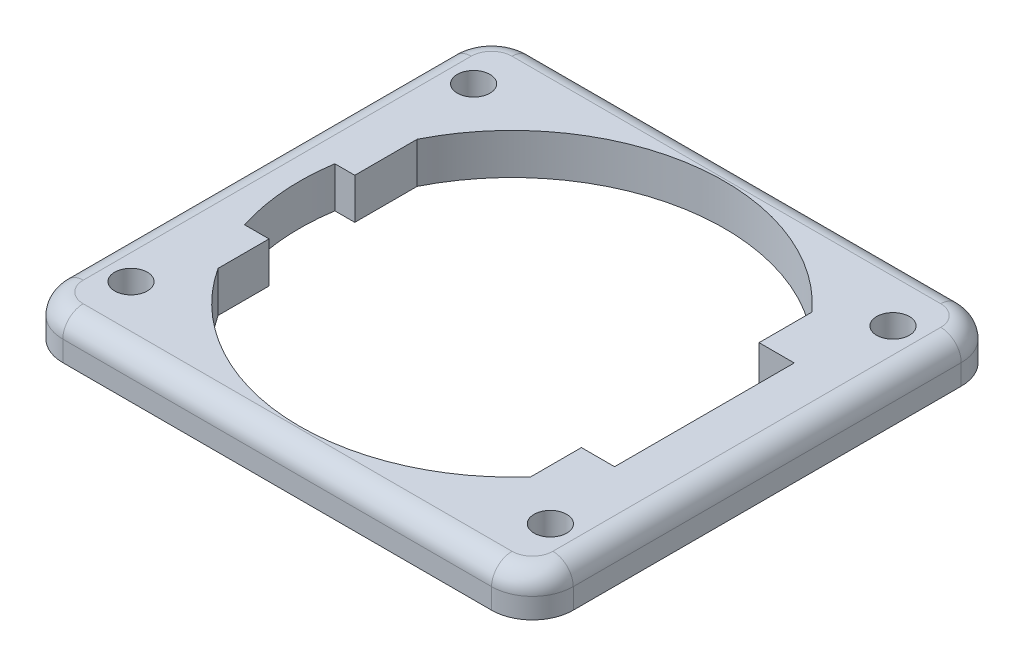
ISO-10303-21;
HEADER;
FILE_DESCRIPTION(('STEP AP214'),'2;1');
FILE_NAME('part.step','',(''),(''),'','','');
FILE_SCHEMA(('AUTOMOTIVE_DESIGN { 1 0 10303 214 1 1 1 1 }'));
ENDSEC;
DATA;
#1=APPLICATION_CONTEXT('core data for automotive mechanical design processes');
#2=APPLICATION_PROTOCOL_DEFINITION('international standard','automotive_design',2000,#1);
#3=PRODUCT_CONTEXT('',#1,'mechanical');
#4=PRODUCT('Part','Part','',(#3));
#5=PRODUCT_RELATED_PRODUCT_CATEGORY('part','',(#4));
#6=PRODUCT_DEFINITION_FORMATION('','',#4);
#7=PRODUCT_DEFINITION_CONTEXT('part definition',#1,'design');
#8=PRODUCT_DEFINITION('design','',#6,#7);
#9=PRODUCT_DEFINITION_SHAPE('','',#8);
#10=(LENGTH_UNIT() NAMED_UNIT(*) SI_UNIT(.MILLI.,.METRE.));
#11=(NAMED_UNIT(*) PLANE_ANGLE_UNIT() SI_UNIT($,.RADIAN.));
#12=(NAMED_UNIT(*) SI_UNIT($,.STERADIAN.) SOLID_ANGLE_UNIT());
#13=UNCERTAINTY_MEASURE_WITH_UNIT(LENGTH_MEASURE(1.E-05),#10,'distance_accuracy_value','');
#14=(GEOMETRIC_REPRESENTATION_CONTEXT(3) GLOBAL_UNCERTAINTY_ASSIGNED_CONTEXT((#13)) GLOBAL_UNIT_ASSIGNED_CONTEXT((#10,
#11,#12)) REPRESENTATION_CONTEXT('',''));
#15=CARTESIAN_POINT('',(0.,0.,0.));
#16=DIRECTION('',(0.,0.,1.));
#17=DIRECTION('',(1.,0.,0.));
#18=AXIS2_PLACEMENT_3D('',#15,#16,#17);
#19=CARTESIAN_POINT('',(0.,2.54,0.));
#20=DIRECTION('',(0.,1.,0.));
#21=DIRECTION('',(0.,0.,1.));
#22=AXIS2_PLACEMENT_3D('',#19,#20,#21);
#23=PLANE('',#22);
#24=CARTESIAN_POINT('',(13.0429,2.54,10.6553));
#25=DIRECTION('',(0.,-1.,0.));
#26=DIRECTION('',(0.,0.,1.));
#27=AXIS2_PLACEMENT_3D('',#24,#25,#26);
#28=CIRCLE('',#27,1.016);
#29=CARTESIAN_POINT('',(13.0429,2.54,11.6713));
#30=VERTEX_POINT('',#29);
#31=EDGE_CURVE('E794',#30,#30,#28,.T.);
#32=ORIENTED_EDGE('',*,*,#31,.T.);
#33=EDGE_LOOP('',(#32));
#34=FACE_BOUND('',#33,.T.);
#35=CARTESIAN_POINT('',(-13.0429,2.54,10.6553));
#36=DIRECTION('',(0.,-1.,0.));
#37=DIRECTION('',(0.,0.,-1.));
#38=AXIS2_PLACEMENT_3D('',#35,#36,#37);
#39=CIRCLE('',#38,1.016);
#40=CARTESIAN_POINT('',(-13.0429,2.54,9.63929999999999));
#41=VERTEX_POINT('',#40);
#42=EDGE_CURVE('E814',#41,#41,#39,.T.);
#43=ORIENTED_EDGE('',*,*,#42,.T.);
#44=EDGE_LOOP('',(#43));
#45=FACE_BOUND('',#44,.T.);
#46=CARTESIAN_POINT('',(-13.0429,2.54,-10.6553));
#47=DIRECTION('',(0.,-1.,0.));
#48=DIRECTION('',(0.,0.,1.));
#49=AXIS2_PLACEMENT_3D('',#46,#47,#48);
#50=CIRCLE('',#49,1.016);
#51=CARTESIAN_POINT('',(-13.0429,2.54,-9.63929999999999));
#52=VERTEX_POINT('',#51);
#53=EDGE_CURVE('E805',#52,#52,#50,.T.);
#54=ORIENTED_EDGE('',*,*,#53,.T.);
#55=EDGE_LOOP('',(#54));
#56=FACE_BOUND('',#55,.T.);
#57=CARTESIAN_POINT('',(13.0429,2.54,-10.6553));
#58=DIRECTION('',(0.,-1.,0.));
#59=DIRECTION('',(0.,0.,-1.));
#60=AXIS2_PLACEMENT_3D('',#57,#58,#59);
#61=CIRCLE('',#60,1.016);
#62=CARTESIAN_POINT('',(13.0429,2.54,-11.6713));
#63=VERTEX_POINT('',#62);
#64=EDGE_CURVE('E229',#63,#63,#61,.T.);
#65=ORIENTED_EDGE('',*,*,#64,.T.);
#66=EDGE_LOOP('',(#65));
#67=FACE_BOUND('',#66,.T.);
#68=CARTESIAN_POINT('',(0.,2.54,0.));
#69=DIRECTION('',(0.,1.,0.));
#70=DIRECTION('',(0.,0.,1.));
#71=AXIS2_PLACEMENT_3D('',#68,#69,#70);
#72=CIRCLE('',#71,13.208);
#73=CARTESIAN_POINT('',(9.779,2.54,-8.87819931067106));
#74=VERTEX_POINT('',#73);
#75=CARTESIAN_POINT('',(-11.811,2.54,-5.91198300065215));
#76=VERTEX_POINT('',#75);
#77=EDGE_CURVE('E277',#74,#76,#72,.T.);
#78=ORIENTED_EDGE('',*,*,#77,.F.);
#79=DIRECTION('',(0.,0.,1.));
#80=VECTOR('',#79,1.);
#81=CARTESIAN_POINT('',(9.779,2.54,-10.2275217065993));
#82=LINE('',#81,#80);
#83=CARTESIAN_POINT('',(9.779,2.54,-5.588));
#84=VERTEX_POINT('',#83);
#85=EDGE_CURVE('E227',#74,#84,#82,.T.);
#86=ORIENTED_EDGE('',*,*,#85,.T.);
#87=DIRECTION('',(1.,0.,0.));
#88=VECTOR('',#87,1.);
#89=CARTESIAN_POINT('',(15.875,2.54,-5.588));
#90=LINE('',#89,#88);
#91=CARTESIAN_POINT('',(11.96768649322,2.54,-5.588));
#92=VERTEX_POINT('',#91);
#93=EDGE_CURVE('E211',#84,#92,#90,.T.);
#94=ORIENTED_EDGE('',*,*,#93,.T.);
#95=DIRECTION('',(0.,0.,-1.));
#96=VECTOR('',#95,1.);
#97=CARTESIAN_POINT('',(11.96768649322,2.54,-5.588));
#98=LINE('',#97,#96);
#99=CARTESIAN_POINT('',(11.96768649322,2.54,5.588));
#100=VERTEX_POINT('',#99);
#101=EDGE_CURVE('E279',#100,#92,#98,.T.);
#102=ORIENTED_EDGE('',*,*,#101,.F.);
#103=DIRECTION('',(-1.,0.,0.));
#104=VECTOR('',#103,1.);
#105=CARTESIAN_POINT('',(15.875,2.54,5.588));
#106=LINE('',#105,#104);
#107=CARTESIAN_POINT('',(9.906,2.54,5.588));
#108=VERTEX_POINT('',#107);
#109=EDGE_CURVE('E232',#100,#108,#106,.T.);
#110=ORIENTED_EDGE('',*,*,#109,.T.);
#111=DIRECTION('',(0.,0.,1.));
#112=VECTOR('',#111,1.);
#113=CARTESIAN_POINT('',(9.906,2.54,5.588));
#114=LINE('',#113,#112);
#115=CARTESIAN_POINT('',(9.906,2.54,8.73627082913528));
#116=VERTEX_POINT('',#115);
#117=EDGE_CURVE('E236',#108,#116,#114,.T.);
#118=ORIENTED_EDGE('',*,*,#117,.T.);
#119=CARTESIAN_POINT('',(-11.049,2.54,7.23677158683346));
#120=VERTEX_POINT('',#119);
#121=EDGE_CURVE('E270',#120,#116,#72,.T.);
#122=ORIENTED_EDGE('',*,*,#121,.F.);
#123=DIRECTION('',(0.,0.,-1.));
#124=VECTOR('',#123,1.);
#125=CARTESIAN_POINT('',(-11.049,2.54,14.605));
#126=LINE('',#125,#124);
#127=CARTESIAN_POINT('',(-11.049,2.54,4.064));
#128=VERTEX_POINT('',#127);
#129=EDGE_CURVE('E244',#120,#128,#126,.T.);
#130=ORIENTED_EDGE('',*,*,#129,.T.);
#131=DIRECTION('',(-1.,0.,0.));
#132=VECTOR('',#131,1.);
#133=CARTESIAN_POINT('',(-15.875,2.54,4.064));
#134=LINE('',#133,#132);
#135=CARTESIAN_POINT('',(-12.5672259468826,2.54,4.064));
#136=VERTEX_POINT('',#135);
#137=EDGE_CURVE('E248',#128,#136,#134,.T.);
#138=ORIENTED_EDGE('',*,*,#137,.T.);
#139=CARTESIAN_POINT('',(-13.0507562999238,2.54,-2.032));
#140=VERTEX_POINT('',#139);
#141=EDGE_CURVE('E280',#140,#136,#72,.T.);
#142=ORIENTED_EDGE('',*,*,#141,.F.);
#143=DIRECTION('',(1.,0.,0.));
#144=VECTOR('',#143,1.);
#145=CARTESIAN_POINT('',(-15.875,2.54,-2.032));
#146=LINE('',#145,#144);
#147=CARTESIAN_POINT('',(-11.811,2.54,-2.032));
#148=VERTEX_POINT('',#147);
#149=EDGE_CURVE('E257',#140,#148,#146,.T.);
#150=ORIENTED_EDGE('',*,*,#149,.T.);
#151=DIRECTION('',(0.,0.,-1.));
#152=VECTOR('',#151,1.);
#153=CARTESIAN_POINT('',(-11.811,2.54,-6.2959526167384));
#154=LINE('',#153,#152);
#155=EDGE_CURVE('E261',#148,#76,#154,.T.);
#156=ORIENTED_EDGE('',*,*,#155,.T.);
#157=EDGE_LOOP('',(#78,#86,#94,#102,#110,#118,#122,#130,#138,#142,#150,#156));
#158=FACE_BOUND('',#157,.T.);
#159=CARTESIAN_POINT('',(13.335,2.54,12.065));
#160=DIRECTION('',(0.,1.,0.));
#161=DIRECTION('',(0.,0.,1.));
#162=AXIS2_PLACEMENT_3D('',#159,#160,#161);
#163=CIRCLE('',#162,1.27);
#164=CARTESIAN_POINT('',(14.605,2.54,12.065));
#165=VERTEX_POINT('',#164);
#166=CARTESIAN_POINT('',(13.335,2.54,13.335));
#167=VERTEX_POINT('',#166);
#168=EDGE_CURVE('E341',#165,#167,#163,.F.);
#169=ORIENTED_EDGE('',*,*,#168,.F.);
#170=DIRECTION('',(0.,0.,-1.));
#171=VECTOR('',#170,1.);
#172=CARTESIAN_POINT('',(14.605,2.54,-14.605));
#173=LINE('',#172,#171);
#174=CARTESIAN_POINT('',(14.605,2.54,-12.065));
#175=VERTEX_POINT('',#174);
#176=EDGE_CURVE('E314',#165,#175,#173,.T.);
#177=ORIENTED_EDGE('',*,*,#176,.T.);
#178=CARTESIAN_POINT('',(13.335,2.54,-12.065));
#179=DIRECTION('',(0.,1.,0.));
#180=DIRECTION('',(0.,0.,1.));
#181=AXIS2_PLACEMENT_3D('',#178,#179,#180);
#182=CIRCLE('',#181,1.27);
#183=CARTESIAN_POINT('',(13.335,2.54,-13.335));
#184=VERTEX_POINT('',#183);
#185=EDGE_CURVE('E334',#184,#175,#182,.F.);
#186=ORIENTED_EDGE('',*,*,#185,.F.);
#187=DIRECTION('',(-1.,0.,0.));
#188=VECTOR('',#187,1.);
#189=CARTESIAN_POINT('',(-15.875,2.54,-13.335));
#190=LINE('',#189,#188);
#191=CARTESIAN_POINT('',(-13.335,2.54,-13.335));
#192=VERTEX_POINT('',#191);
#193=EDGE_CURVE('E317',#184,#192,#190,.T.);
#194=ORIENTED_EDGE('',*,*,#193,.T.);
#195=CARTESIAN_POINT('',(-13.335,2.54,-12.065));
#196=DIRECTION('',(0.,1.,0.));
#197=DIRECTION('',(0.,0.,1.));
#198=AXIS2_PLACEMENT_3D('',#195,#196,#197);
#199=CIRCLE('',#198,1.27);
#200=CARTESIAN_POINT('',(-14.605,2.54,-12.065));
#201=VERTEX_POINT('',#200);
#202=EDGE_CURVE('E336',#201,#192,#199,.F.);
#203=ORIENTED_EDGE('',*,*,#202,.F.);
#204=DIRECTION('',(0.,0.,1.));
#205=VECTOR('',#204,1.);
#206=CARTESIAN_POINT('',(-14.605,2.54,14.605));
#207=LINE('',#206,#205);
#208=CARTESIAN_POINT('',(-14.605,2.54,12.065));
#209=VERTEX_POINT('',#208);
#210=EDGE_CURVE('E320',#201,#209,#207,.T.);
#211=ORIENTED_EDGE('',*,*,#210,.T.);
#212=CARTESIAN_POINT('',(-13.335,2.54,12.065));
#213=DIRECTION('',(0.,1.,0.));
#214=DIRECTION('',(0.,0.,1.));
#215=AXIS2_PLACEMENT_3D('',#212,#213,#214);
#216=CIRCLE('',#215,1.27);
#217=CARTESIAN_POINT('',(-13.335,2.54,13.335));
#218=VERTEX_POINT('',#217);
#219=EDGE_CURVE('E338',#218,#209,#216,.F.);
#220=ORIENTED_EDGE('',*,*,#219,.F.);
#221=DIRECTION('',(1.,0.,0.));
#222=VECTOR('',#221,1.);
#223=CARTESIAN_POINT('',(15.875,2.54,13.335));
#224=LINE('',#223,#222);
#225=EDGE_CURVE('E311',#218,#167,#224,.T.);
#226=ORIENTED_EDGE('',*,*,#225,.T.);
#227=EDGE_LOOP('',(#169,#177,#186,#194,#203,#211,#220,#226));
#228=FACE_BOUND('',#227,.T.);
#229=ADVANCED_FACE('F36',(#34,#45,#56,#67,#158,#228),#23,.T.);
#230=CARTESIAN_POINT('',(0.,0.,0.));
#231=DIRECTION('',(0.,1.,0.));
#232=DIRECTION('',(0.,0.,1.));
#233=AXIS2_PLACEMENT_3D('',#230,#231,#232);
#234=CYLINDRICAL_SURFACE('',#233,13.208);
#235=ORIENTED_EDGE('',*,*,#141,.T.);
#236=DIRECTION('',(0.,1.,0.));
#237=VECTOR('',#236,1.);
#238=CARTESIAN_POINT('',(-12.5672259468826,0.,4.064));
#239=LINE('',#238,#237);
#240=CARTESIAN_POINT('',(-12.5672259468826,0.,4.064));
#241=VERTEX_POINT('',#240);
#242=EDGE_CURVE('E306',#136,#241,#239,.F.);
#243=ORIENTED_EDGE('',*,*,#242,.T.);
#244=CARTESIAN_POINT('',(0.,0.,0.));
#245=DIRECTION('',(0.,1.,0.));
#246=DIRECTION('',(0.,0.,1.));
#247=AXIS2_PLACEMENT_3D('',#244,#245,#246);
#248=CIRCLE('',#247,13.208);
#249=CARTESIAN_POINT('',(-13.0507562999238,0.,-2.032));
#250=VERTEX_POINT('',#249);
#251=EDGE_CURVE('E273',#250,#241,#248,.T.);
#252=ORIENTED_EDGE('',*,*,#251,.F.);
#253=DIRECTION('',(0.,1.,0.));
#254=VECTOR('',#253,1.);
#255=CARTESIAN_POINT('',(-13.0507562999238,0.,-2.032));
#256=LINE('',#255,#254);
#257=EDGE_CURVE('E297',#250,#140,#256,.T.);
#258=ORIENTED_EDGE('',*,*,#257,.T.);
#259=EDGE_LOOP('',(#235,#243,#252,#258));
#260=FACE_BOUND('',#259,.T.);
#261=ADVANCED_FACE('F462',(#260),#234,.F.);
#262=CARTESIAN_POINT('',(9.779,0.,-8.87819931067106));
#263=VERTEX_POINT('',#262);
#264=CARTESIAN_POINT('',(-11.811,0.,-5.91198300065215));
#265=VERTEX_POINT('',#264);
#266=EDGE_CURVE('E271',#263,#265,#248,.T.);
#267=ORIENTED_EDGE('',*,*,#266,.F.);
#268=DIRECTION('',(0.,1.,0.));
#269=VECTOR('',#268,1.);
#270=CARTESIAN_POINT('',(9.779,0.,-8.87819931067106));
#271=LINE('',#270,#269);
#272=EDGE_CURVE('E207',#263,#74,#271,.T.);
#273=ORIENTED_EDGE('',*,*,#272,.T.);
#274=ORIENTED_EDGE('',*,*,#77,.T.);
#275=DIRECTION('',(0.,1.,0.));
#276=VECTOR('',#275,1.);
#277=CARTESIAN_POINT('',(-11.811,0.,-5.91198300065215));
#278=LINE('',#277,#276);
#279=EDGE_CURVE('E300',#76,#265,#278,.F.);
#280=ORIENTED_EDGE('',*,*,#279,.T.);
#281=EDGE_LOOP('',(#267,#273,#274,#280));
#282=FACE_BOUND('',#281,.T.);
#283=ADVANCED_FACE('F468',(#282),#234,.F.);
#284=CARTESIAN_POINT('',(-15.875,2.54,-14.605));
#285=DIRECTION('',(1.,0.,0.));
#286=DIRECTION('',(0.,0.,-1.));
#287=AXIS2_PLACEMENT_3D('',#284,#285,#286);
#288=PLANE('',#287);
#289=DIRECTION('',(0.,0.,1.));
#290=VECTOR('',#289,1.);
#291=CARTESIAN_POINT('',(-15.875,1.27,-14.605));
#292=LINE('',#291,#290);
#293=CARTESIAN_POINT('',(-15.875,1.27,12.065));
#294=VERTEX_POINT('',#293);
#295=CARTESIAN_POINT('',(-15.875,1.27,-12.065));
#296=VERTEX_POINT('',#295);
#297=EDGE_CURVE('E323',#294,#296,#292,.F.);
#298=ORIENTED_EDGE('',*,*,#297,.T.);
#299=DIRECTION('',(0.,-1.,0.));
#300=VECTOR('',#299,1.);
#301=CARTESIAN_POINT('',(-15.875,2.54,-12.065));
#302=LINE('',#301,#300);
#303=CARTESIAN_POINT('',(-15.875,0.,-12.065));
#304=VERTEX_POINT('',#303);
#305=EDGE_CURVE('E60',#296,#304,#302,.T.);
#306=ORIENTED_EDGE('',*,*,#305,.T.);
#307=DIRECTION('',(0.,0.,1.));
#308=VECTOR('',#307,1.);
#309=CARTESIAN_POINT('',(-15.875,0.,-14.605));
#310=LINE('',#309,#308);
#311=CARTESIAN_POINT('',(-15.875,0.,12.065));
#312=VERTEX_POINT('',#311);
#313=EDGE_CURVE('E284',#304,#312,#310,.T.);
#314=ORIENTED_EDGE('',*,*,#313,.T.);
#315=DIRECTION('',(0.,-1.,0.));
#316=VECTOR('',#315,1.);
#317=CARTESIAN_POINT('',(-15.875,2.54,12.065));
#318=LINE('',#317,#316);
#319=EDGE_CURVE('E377',#312,#294,#318,.F.);
#320=ORIENTED_EDGE('',*,*,#319,.T.);
#321=EDGE_LOOP('',(#298,#306,#314,#320));
#322=FACE_BOUND('',#321,.T.);
#323=ADVANCED_FACE('F449',(#322),#288,.F.);
#324=CARTESIAN_POINT('',(-15.875,2.54,14.605));
#325=DIRECTION('',(0.,0.,-1.));
#326=DIRECTION('',(-1.,0.,0.));
#327=AXIS2_PLACEMENT_3D('',#324,#325,#326);
#328=PLANE('',#327);
#329=DIRECTION('',(1.,0.,0.));
#330=VECTOR('',#329,1.);
#331=CARTESIAN_POINT('',(-15.875,1.27,14.605));
#332=LINE('',#331,#330);
#333=CARTESIAN_POINT('',(13.335,1.27,14.605));
#334=VERTEX_POINT('',#333);
#335=CARTESIAN_POINT('',(-13.335,1.27,14.605));
#336=VERTEX_POINT('',#335);
#337=EDGE_CURVE('E331',#334,#336,#332,.F.);
#338=ORIENTED_EDGE('',*,*,#337,.T.);
#339=DIRECTION('',(0.,-1.,0.));
#340=VECTOR('',#339,1.);
#341=CARTESIAN_POINT('',(-13.335,2.54,14.605));
#342=LINE('',#341,#340);
#343=CARTESIAN_POINT('',(-13.335,0.,14.605));
#344=VERTEX_POINT('',#343);
#345=EDGE_CURVE('E11',#336,#344,#342,.T.);
#346=ORIENTED_EDGE('',*,*,#345,.T.);
#347=DIRECTION('',(1.,0.,0.));
#348=VECTOR('',#347,1.);
#349=CARTESIAN_POINT('',(-15.875,0.,14.605));
#350=LINE('',#349,#348);
#351=CARTESIAN_POINT('',(13.335,0.,14.605));
#352=VERTEX_POINT('',#351);
#353=EDGE_CURVE('E288',#344,#352,#350,.T.);
#354=ORIENTED_EDGE('',*,*,#353,.T.);
#355=DIRECTION('',(0.,-1.,0.));
#356=VECTOR('',#355,1.);
#357=CARTESIAN_POINT('',(13.335,2.54,14.605));
#358=LINE('',#357,#356);
#359=EDGE_CURVE('E45',#352,#334,#358,.F.);
#360=ORIENTED_EDGE('',*,*,#359,.T.);
#361=EDGE_LOOP('',(#338,#346,#354,#360));
#362=FACE_BOUND('',#361,.T.);
#363=ADVANCED_FACE('F444',(#362),#328,.F.);
#364=CARTESIAN_POINT('',(15.875,2.54,-14.605));
#365=DIRECTION('',(-1.,0.,0.));
#366=DIRECTION('',(0.,0.,1.));
#367=AXIS2_PLACEMENT_3D('',#364,#365,#366);
#368=PLANE('',#367);
#369=DIRECTION('',(0.,0.,-1.));
#370=VECTOR('',#369,1.);
#371=CARTESIAN_POINT('',(15.875,0.,-14.605));
#372=LINE('',#371,#370);
#373=CARTESIAN_POINT('',(15.875,0.,12.065));
#374=VERTEX_POINT('',#373);
#375=CARTESIAN_POINT('',(15.875,0.,-12.065));
#376=VERTEX_POINT('',#375);
#377=EDGE_CURVE('E291',#374,#376,#372,.T.);
#378=ORIENTED_EDGE('',*,*,#377,.T.);
#379=DIRECTION('',(0.,-1.,0.));
#380=VECTOR('',#379,1.);
#381=CARTESIAN_POINT('',(15.875,2.54,-12.065));
#382=LINE('',#381,#380);
#383=CARTESIAN_POINT('',(15.875,1.27,-12.065));
#384=VERTEX_POINT('',#383);
#385=EDGE_CURVE('E375',#376,#384,#382,.F.);
#386=ORIENTED_EDGE('',*,*,#385,.T.);
#387=DIRECTION('',(0.,0.,-1.));
#388=VECTOR('',#387,1.);
#389=CARTESIAN_POINT('',(15.875,1.27,14.605));
#390=LINE('',#389,#388);
#391=CARTESIAN_POINT('',(15.875,1.27,12.065));
#392=VERTEX_POINT('',#391);
#393=EDGE_CURVE('E328',#384,#392,#390,.F.);
#394=ORIENTED_EDGE('',*,*,#393,.T.);
#395=DIRECTION('',(0.,-1.,0.));
#396=VECTOR('',#395,1.);
#397=CARTESIAN_POINT('',(15.875,2.54,12.065));
#398=LINE('',#397,#396);
#399=EDGE_CURVE('E373',#392,#374,#398,.T.);
#400=ORIENTED_EDGE('',*,*,#399,.T.);
#401=EDGE_LOOP('',(#378,#386,#394,#400));
#402=FACE_BOUND('',#401,.T.);
#403=ADVANCED_FACE('F424',(#402),#368,.F.);
#404=CARTESIAN_POINT('',(-15.875,2.54,-14.605));
#405=DIRECTION('',(0.,0.,1.));
#406=DIRECTION('',(1.,0.,0.));
#407=AXIS2_PLACEMENT_3D('',#404,#405,#406);
#408=PLANE('',#407);
#409=DIRECTION('',(-1.,0.,0.));
#410=VECTOR('',#409,1.);
#411=CARTESIAN_POINT('',(15.875,1.27,-14.605));
#412=LINE('',#411,#410);
#413=CARTESIAN_POINT('',(-13.335,1.27,-14.605));
#414=VERTEX_POINT('',#413);
#415=CARTESIAN_POINT('',(13.335,1.27,-14.605));
#416=VERTEX_POINT('',#415);
#417=EDGE_CURVE('E325',#414,#416,#412,.F.);
#418=ORIENTED_EDGE('',*,*,#417,.T.);
#419=DIRECTION('',(0.,-1.,0.));
#420=VECTOR('',#419,1.);
#421=CARTESIAN_POINT('',(13.335,2.54,-14.605));
#422=LINE('',#421,#420);
#423=CARTESIAN_POINT('',(13.335,0.,-14.605));
#424=VERTEX_POINT('',#423);
#425=EDGE_CURVE('E364',#416,#424,#422,.T.);
#426=ORIENTED_EDGE('',*,*,#425,.T.);
#427=DIRECTION('',(-1.,0.,0.));
#428=VECTOR('',#427,1.);
#429=CARTESIAN_POINT('',(-15.875,0.,-14.605));
#430=LINE('',#429,#428);
#431=CARTESIAN_POINT('',(-13.335,0.,-14.605));
#432=VERTEX_POINT('',#431);
#433=EDGE_CURVE('E294',#424,#432,#430,.T.);
#434=ORIENTED_EDGE('',*,*,#433,.T.);
#435=DIRECTION('',(0.,-1.,0.));
#436=VECTOR('',#435,1.);
#437=CARTESIAN_POINT('',(-13.335,2.54,-14.605));
#438=LINE('',#437,#436);
#439=EDGE_CURVE('E362',#432,#414,#438,.F.);
#440=ORIENTED_EDGE('',*,*,#439,.T.);
#441=EDGE_LOOP('',(#418,#426,#434,#440));
#442=FACE_BOUND('',#441,.T.);
#443=ADVANCED_FACE('F405',(#442),#408,.F.);
#444=CARTESIAN_POINT('',(0.,0.,0.));
#445=DIRECTION('',(0.,1.,0.));
#446=DIRECTION('',(0.,0.,1.));
#447=AXIS2_PLACEMENT_3D('',#444,#445,#446);
#448=PLANE('',#447);
#449=CARTESIAN_POINT('',(13.0429,0.,10.6553));
#450=DIRECTION('',(0.,-1.,0.));
#451=DIRECTION('',(0.,0.,1.));
#452=AXIS2_PLACEMENT_3D('',#449,#450,#451);
#453=CIRCLE('',#452,1.016);
#454=CARTESIAN_POINT('',(13.0429,0.,11.6713));
#455=VERTEX_POINT('',#454);
#456=EDGE_CURVE('E384',#455,#455,#453,.T.);
#457=ORIENTED_EDGE('',*,*,#456,.F.);
#458=EDGE_LOOP('',(#457));
#459=FACE_BOUND('',#458,.T.);
#460=CARTESIAN_POINT('',(-13.0429,0.,10.6553));
#461=DIRECTION('',(0.,-1.,0.));
#462=DIRECTION('',(0.,0.,-1.));
#463=AXIS2_PLACEMENT_3D('',#460,#461,#462);
#464=CIRCLE('',#463,1.016);
#465=CARTESIAN_POINT('',(-13.0429,0.,9.63929999999999));
#466=VERTEX_POINT('',#465);
#467=EDGE_CURVE('E798',#466,#466,#464,.T.);
#468=ORIENTED_EDGE('',*,*,#467,.F.);
#469=EDGE_LOOP('',(#468));
#470=FACE_BOUND('',#469,.T.);
#471=CARTESIAN_POINT('',(-13.0429,0.,-10.6553));
#472=DIRECTION('',(0.,-1.,0.));
#473=DIRECTION('',(0.,0.,1.));
#474=AXIS2_PLACEMENT_3D('',#471,#472,#473);
#475=CIRCLE('',#474,1.016);
#476=CARTESIAN_POINT('',(-13.0429,0.,-9.63929999999999));
#477=VERTEX_POINT('',#476);
#478=EDGE_CURVE('E809',#477,#477,#475,.T.);
#479=ORIENTED_EDGE('',*,*,#478,.F.);
#480=EDGE_LOOP('',(#479));
#481=FACE_BOUND('',#480,.T.);
#482=CARTESIAN_POINT('',(13.0429,0.,-10.6553));
#483=DIRECTION('',(0.,-1.,0.));
#484=DIRECTION('',(0.,0.,-1.));
#485=AXIS2_PLACEMENT_3D('',#482,#483,#484);
#486=CIRCLE('',#485,1.016);
#487=CARTESIAN_POINT('',(13.0429,0.,-11.6713));
#488=VERTEX_POINT('',#487);
#489=EDGE_CURVE('E803',#488,#488,#486,.T.);
#490=ORIENTED_EDGE('',*,*,#489,.F.);
#491=EDGE_LOOP('',(#490));
#492=FACE_BOUND('',#491,.T.);
#493=ORIENTED_EDGE('',*,*,#433,.F.);
#494=CARTESIAN_POINT('',(13.335,0.,-12.065));
#495=DIRECTION('',(0.,1.,0.));
#496=DIRECTION('',(0.,0.,1.));
#497=AXIS2_PLACEMENT_3D('',#494,#495,#496);
#498=CIRCLE('',#497,2.54);
#499=EDGE_CURVE('E371',#424,#376,#498,.F.);
#500=ORIENTED_EDGE('',*,*,#499,.T.);
#501=ORIENTED_EDGE('',*,*,#377,.F.);
#502=CARTESIAN_POINT('',(13.335,0.,12.065));
#503=DIRECTION('',(0.,1.,0.));
#504=DIRECTION('',(0.,0.,1.));
#505=AXIS2_PLACEMENT_3D('',#502,#503,#504);
#506=CIRCLE('',#505,2.54);
#507=EDGE_CURVE('E366',#374,#352,#506,.F.);
#508=ORIENTED_EDGE('',*,*,#507,.T.);
#509=ORIENTED_EDGE('',*,*,#353,.F.);
#510=CARTESIAN_POINT('',(-13.335,0.,12.065));
#511=DIRECTION('',(0.,1.,0.));
#512=DIRECTION('',(0.,0.,1.));
#513=AXIS2_PLACEMENT_3D('',#510,#511,#512);
#514=CIRCLE('',#513,2.54);
#515=EDGE_CURVE('E53',#344,#312,#514,.F.);
#516=ORIENTED_EDGE('',*,*,#515,.T.);
#517=ORIENTED_EDGE('',*,*,#313,.F.);
#518=CARTESIAN_POINT('',(-13.335,0.,-12.065));
#519=DIRECTION('',(0.,1.,0.));
#520=DIRECTION('',(0.,0.,1.));
#521=AXIS2_PLACEMENT_3D('',#518,#519,#520);
#522=CIRCLE('',#521,2.54);
#523=EDGE_CURVE('E369',#304,#432,#522,.F.);
#524=ORIENTED_EDGE('',*,*,#523,.T.);
#525=EDGE_LOOP('',(#493,#500,#501,#508,#509,#516,#517,#524));
#526=FACE_BOUND('',#525,.T.);
#527=DIRECTION('',(0.,0.,-1.));
#528=VECTOR('',#527,1.);
#529=CARTESIAN_POINT('',(11.96768649322,0.,-5.588));
#530=LINE('',#529,#528);
#531=CARTESIAN_POINT('',(11.96768649322,0.,5.588));
#532=VERTEX_POINT('',#531);
#533=CARTESIAN_POINT('',(11.96768649322,0.,-5.588));
#534=VERTEX_POINT('',#533);
#535=EDGE_CURVE('E223',#532,#534,#530,.T.);
#536=ORIENTED_EDGE('',*,*,#535,.T.);
#537=DIRECTION('',(1.,0.,0.));
#538=VECTOR('',#537,1.);
#539=CARTESIAN_POINT('',(15.875,0.,-5.588));
#540=LINE('',#539,#538);
#541=CARTESIAN_POINT('',(9.779,0.,-5.588));
#542=VERTEX_POINT('',#541);
#543=EDGE_CURVE('E210',#542,#534,#540,.T.);
#544=ORIENTED_EDGE('',*,*,#543,.F.);
#545=DIRECTION('',(0.,0.,1.));
#546=VECTOR('',#545,1.);
#547=CARTESIAN_POINT('',(9.779,0.,-10.2275217065993));
#548=LINE('',#547,#546);
#549=EDGE_CURVE('E201',#263,#542,#548,.T.);
#550=ORIENTED_EDGE('',*,*,#549,.F.);
#551=ORIENTED_EDGE('',*,*,#266,.T.);
#552=DIRECTION('',(0.,0.,-1.));
#553=VECTOR('',#552,1.);
#554=CARTESIAN_POINT('',(-11.811,0.,-6.2959526167384));
#555=LINE('',#554,#553);
#556=CARTESIAN_POINT('',(-11.811,0.,-2.032));
#557=VERTEX_POINT('',#556);
#558=EDGE_CURVE('E260',#557,#265,#555,.T.);
#559=ORIENTED_EDGE('',*,*,#558,.F.);
#560=DIRECTION('',(1.,0.,0.));
#561=VECTOR('',#560,1.);
#562=CARTESIAN_POINT('',(-15.875,0.,-2.032));
#563=LINE('',#562,#561);
#564=EDGE_CURVE('E258',#250,#557,#563,.T.);
#565=ORIENTED_EDGE('',*,*,#564,.F.);
#566=ORIENTED_EDGE('',*,*,#251,.T.);
#567=DIRECTION('',(-1.,0.,0.));
#568=VECTOR('',#567,1.);
#569=CARTESIAN_POINT('',(-15.875,0.,4.064));
#570=LINE('',#569,#568);
#571=CARTESIAN_POINT('',(-11.049,0.,4.064));
#572=VERTEX_POINT('',#571);
#573=EDGE_CURVE('E247',#572,#241,#570,.T.);
#574=ORIENTED_EDGE('',*,*,#573,.F.);
#575=DIRECTION('',(0.,0.,-1.));
#576=VECTOR('',#575,1.);
#577=CARTESIAN_POINT('',(-11.049,0.,14.605));
#578=LINE('',#577,#576);
#579=CARTESIAN_POINT('',(-11.049,0.,7.23677158683346));
#580=VERTEX_POINT('',#579);
#581=EDGE_CURVE('E245',#580,#572,#578,.T.);
#582=ORIENTED_EDGE('',*,*,#581,.F.);
#583=CARTESIAN_POINT('',(9.906,0.,8.73627082913528));
#584=VERTEX_POINT('',#583);
#585=EDGE_CURVE('E274',#580,#584,#248,.T.);
#586=ORIENTED_EDGE('',*,*,#585,.T.);
#587=DIRECTION('',(0.,0.,1.));
#588=VECTOR('',#587,1.);
#589=CARTESIAN_POINT('',(9.906,0.,5.588));
#590=LINE('',#589,#588);
#591=CARTESIAN_POINT('',(9.906,0.,5.588));
#592=VERTEX_POINT('',#591);
#593=EDGE_CURVE('E235',#592,#584,#590,.T.);
#594=ORIENTED_EDGE('',*,*,#593,.F.);
#595=DIRECTION('',(-1.,0.,0.));
#596=VECTOR('',#595,1.);
#597=CARTESIAN_POINT('',(15.875,0.,5.588));
#598=LINE('',#597,#596);
#599=EDGE_CURVE('E233',#532,#592,#598,.T.);
#600=ORIENTED_EDGE('',*,*,#599,.F.);
#601=EDGE_LOOP('',(#536,#544,#550,#551,#559,#565,#566,#574,#582,#586,#594,#600));
#602=FACE_BOUND('',#601,.T.);
#603=ADVANCED_FACE('F220',(#459,#470,#481,#492,#526,#602),#448,.F.);
#604=ORIENTED_EDGE('',*,*,#121,.T.);
#605=DIRECTION('',(0.,1.,0.));
#606=VECTOR('',#605,1.);
#607=CARTESIAN_POINT('',(9.906,0.,8.73627082913528));
#608=LINE('',#607,#606);
#609=EDGE_CURVE('E308',#116,#584,#608,.F.);
#610=ORIENTED_EDGE('',*,*,#609,.T.);
#611=ORIENTED_EDGE('',*,*,#585,.F.);
#612=DIRECTION('',(0.,1.,0.));
#613=VECTOR('',#612,1.);
#614=CARTESIAN_POINT('',(-11.049,0.,7.23677158683346));
#615=LINE('',#614,#613);
#616=EDGE_CURVE('E303',#580,#120,#615,.T.);
#617=ORIENTED_EDGE('',*,*,#616,.T.);
#618=EDGE_LOOP('',(#604,#610,#611,#617));
#619=FACE_BOUND('',#618,.T.);
#620=ADVANCED_FACE('F471',(#619),#234,.F.);
#621=CARTESIAN_POINT('',(11.96768649322,0.,-5.588));
#622=DIRECTION('',(1.,0.,0.));
#623=DIRECTION('',(0.,0.,-1.));
#624=AXIS2_PLACEMENT_3D('',#621,#622,#623);
#625=PLANE('',#624);
#626=ORIENTED_EDGE('',*,*,#101,.T.);
#627=DIRECTION('',(0.,1.,0.));
#628=VECTOR('',#627,1.);
#629=CARTESIAN_POINT('',(11.96768649322,0.,-5.588));
#630=LINE('',#629,#628);
#631=EDGE_CURVE('E282',#534,#92,#630,.T.);
#632=ORIENTED_EDGE('',*,*,#631,.F.);
#633=ORIENTED_EDGE('',*,*,#535,.F.);
#634=DIRECTION('',(0.,1.,0.));
#635=VECTOR('',#634,1.);
#636=CARTESIAN_POINT('',(11.96768649322,0.,5.588));
#637=LINE('',#636,#635);
#638=EDGE_CURVE('E276',#532,#100,#637,.T.);
#639=ORIENTED_EDGE('',*,*,#638,.T.);
#640=EDGE_LOOP('',(#626,#632,#633,#639));
#641=FACE_BOUND('',#640,.T.);
#642=ADVANCED_FACE('F684',(#641),#625,.F.);
#643=CARTESIAN_POINT('',(-11.811,0.,-6.2959526167384));
#644=DIRECTION('',(1.,0.,0.));
#645=DIRECTION('',(0.,0.,-1.));
#646=AXIS2_PLACEMENT_3D('',#643,#644,#645);
#647=PLANE('',#646);
#648=ORIENTED_EDGE('',*,*,#279,.F.);
#649=ORIENTED_EDGE('',*,*,#155,.F.);
#650=DIRECTION('',(0.,1.,0.));
#651=VECTOR('',#650,1.);
#652=CARTESIAN_POINT('',(-11.811,0.,-2.032));
#653=LINE('',#652,#651);
#654=EDGE_CURVE('E264',#557,#148,#653,.T.);
#655=ORIENTED_EDGE('',*,*,#654,.F.);
#656=ORIENTED_EDGE('',*,*,#558,.T.);
#657=EDGE_LOOP('',(#648,#649,#655,#656));
#658=FACE_BOUND('',#657,.T.);
#659=ADVANCED_FACE('F681',(#658),#647,.T.);
#660=CARTESIAN_POINT('',(-15.875,0.,-2.032));
#661=DIRECTION('',(0.,0.,1.));
#662=DIRECTION('',(1.,0.,0.));
#663=AXIS2_PLACEMENT_3D('',#660,#661,#662);
#664=PLANE('',#663);
#665=ORIENTED_EDGE('',*,*,#257,.F.);
#666=ORIENTED_EDGE('',*,*,#564,.T.);
#667=ORIENTED_EDGE('',*,*,#654,.T.);
#668=ORIENTED_EDGE('',*,*,#149,.F.);
#669=EDGE_LOOP('',(#665,#666,#667,#668));
#670=FACE_BOUND('',#669,.T.);
#671=ADVANCED_FACE('F676',(#670),#664,.T.);
#672=CARTESIAN_POINT('',(-15.875,0.,4.064));
#673=DIRECTION('',(0.,0.,-1.));
#674=DIRECTION('',(-1.,0.,0.));
#675=AXIS2_PLACEMENT_3D('',#672,#673,#674);
#676=PLANE('',#675);
#677=ORIENTED_EDGE('',*,*,#242,.F.);
#678=ORIENTED_EDGE('',*,*,#137,.F.);
#679=DIRECTION('',(0.,1.,0.));
#680=VECTOR('',#679,1.);
#681=CARTESIAN_POINT('',(-11.049,0.,4.064));
#682=LINE('',#681,#680);
#683=EDGE_CURVE('E251',#572,#128,#682,.T.);
#684=ORIENTED_EDGE('',*,*,#683,.F.);
#685=ORIENTED_EDGE('',*,*,#573,.T.);
#686=EDGE_LOOP('',(#677,#678,#684,#685));
#687=FACE_BOUND('',#686,.T.);
#688=ADVANCED_FACE('F673',(#687),#676,.T.);
#689=CARTESIAN_POINT('',(-11.049,0.,14.605));
#690=DIRECTION('',(1.,0.,0.));
#691=DIRECTION('',(0.,0.,-1.));
#692=AXIS2_PLACEMENT_3D('',#689,#690,#691);
#693=PLANE('',#692);
#694=ORIENTED_EDGE('',*,*,#616,.F.);
#695=ORIENTED_EDGE('',*,*,#581,.T.);
#696=ORIENTED_EDGE('',*,*,#683,.T.);
#697=ORIENTED_EDGE('',*,*,#129,.F.);
#698=EDGE_LOOP('',(#694,#695,#696,#697));
#699=FACE_BOUND('',#698,.T.);
#700=ADVANCED_FACE('F668',(#699),#693,.T.);
#701=CARTESIAN_POINT('',(9.906,0.,5.588));
#702=DIRECTION('',(-1.,0.,0.));
#703=DIRECTION('',(0.,0.,1.));
#704=AXIS2_PLACEMENT_3D('',#701,#702,#703);
#705=PLANE('',#704);
#706=ORIENTED_EDGE('',*,*,#609,.F.);
#707=ORIENTED_EDGE('',*,*,#117,.F.);
#708=DIRECTION('',(0.,1.,0.));
#709=VECTOR('',#708,1.);
#710=CARTESIAN_POINT('',(9.906,0.,5.588));
#711=LINE('',#710,#709);
#712=EDGE_CURVE('E238',#592,#108,#711,.T.);
#713=ORIENTED_EDGE('',*,*,#712,.F.);
#714=ORIENTED_EDGE('',*,*,#593,.T.);
#715=EDGE_LOOP('',(#706,#707,#713,#714));
#716=FACE_BOUND('',#715,.T.);
#717=ADVANCED_FACE('F665',(#716),#705,.T.);
#718=CARTESIAN_POINT('',(15.875,0.,5.588));
#719=DIRECTION('',(0.,0.,-1.));
#720=DIRECTION('',(-1.,0.,0.));
#721=AXIS2_PLACEMENT_3D('',#718,#719,#720);
#722=PLANE('',#721);
#723=ORIENTED_EDGE('',*,*,#638,.F.);
#724=ORIENTED_EDGE('',*,*,#599,.T.);
#725=ORIENTED_EDGE('',*,*,#712,.T.);
#726=ORIENTED_EDGE('',*,*,#109,.F.);
#727=EDGE_LOOP('',(#723,#724,#725,#726));
#728=FACE_BOUND('',#727,.T.);
#729=ADVANCED_FACE('F664',(#728),#722,.T.);
#730=CARTESIAN_POINT('',(9.779,0.,-10.2275217065993));
#731=DIRECTION('',(-1.,0.,0.));
#732=DIRECTION('',(0.,0.,1.));
#733=AXIS2_PLACEMENT_3D('',#730,#731,#732);
#734=PLANE('',#733);
#735=ORIENTED_EDGE('',*,*,#272,.F.);
#736=ORIENTED_EDGE('',*,*,#549,.T.);
#737=DIRECTION('',(0.,1.,0.));
#738=VECTOR('',#737,1.);
#739=CARTESIAN_POINT('',(9.779,0.,-5.588));
#740=LINE('',#739,#738);
#741=EDGE_CURVE('E205',#542,#84,#740,.T.);
#742=ORIENTED_EDGE('',*,*,#741,.T.);
#743=ORIENTED_EDGE('',*,*,#85,.F.);
#744=EDGE_LOOP('',(#735,#736,#742,#743));
#745=FACE_BOUND('',#744,.T.);
#746=ADVANCED_FACE('F203',(#745),#734,.T.);
#747=CARTESIAN_POINT('',(15.875,0.,-5.588));
#748=DIRECTION('',(0.,0.,1.));
#749=DIRECTION('',(1.,0.,0.));
#750=AXIS2_PLACEMENT_3D('',#747,#748,#749);
#751=PLANE('',#750);
#752=ORIENTED_EDGE('',*,*,#631,.T.);
#753=ORIENTED_EDGE('',*,*,#93,.F.);
#754=ORIENTED_EDGE('',*,*,#741,.F.);
#755=ORIENTED_EDGE('',*,*,#543,.T.);
#756=EDGE_LOOP('',(#752,#753,#754,#755));
#757=FACE_BOUND('',#756,.T.);
#758=ADVANCED_FACE('F216',(#757),#751,.T.);
#759=CARTESIAN_POINT('',(14.605,1.27,0.));
#760=DIRECTION('',(0.,0.,1.));
#761=DIRECTION('',(1.,0.,0.));
#762=AXIS2_PLACEMENT_3D('',#759,#760,#761);
#763=CYLINDRICAL_SURFACE('',#762,1.27);
#764=ORIENTED_EDGE('',*,*,#393,.F.);
#765=CARTESIAN_POINT('',(14.605,1.27,-12.065));
#766=DIRECTION('',(0.,0.,1.));
#767=DIRECTION('',(1.,0.,0.));
#768=AXIS2_PLACEMENT_3D('',#765,#766,#767);
#769=CIRCLE('',#768,1.27);
#770=EDGE_CURVE('E359',#384,#175,#769,.T.);
#771=ORIENTED_EDGE('',*,*,#770,.T.);
#772=ORIENTED_EDGE('',*,*,#176,.F.);
#773=CARTESIAN_POINT('',(14.605,1.27,12.065));
#774=DIRECTION('',(0.,0.,-1.));
#775=DIRECTION('',(-1.,0.,0.));
#776=AXIS2_PLACEMENT_3D('',#773,#774,#775);
#777=CIRCLE('',#776,1.27);
#778=EDGE_CURVE('E357',#165,#392,#777,.T.);
#779=ORIENTED_EDGE('',*,*,#778,.T.);
#780=EDGE_LOOP('',(#764,#771,#772,#779));
#781=FACE_BOUND('',#780,.T.);
#782=ADVANCED_FACE('F421',(#781),#763,.T.);
#783=CARTESIAN_POINT('',(0.,1.27,-13.335));
#784=DIRECTION('',(1.,0.,0.));
#785=DIRECTION('',(0.,0.,-1.));
#786=AXIS2_PLACEMENT_3D('',#783,#784,#785);
#787=CYLINDRICAL_SURFACE('',#786,1.27);
#788=ORIENTED_EDGE('',*,*,#417,.F.);
#789=CARTESIAN_POINT('',(-13.335,1.27,-13.335));
#790=DIRECTION('',(1.,0.,0.));
#791=DIRECTION('',(0.,0.,-1.));
#792=AXIS2_PLACEMENT_3D('',#789,#790,#791);
#793=CIRCLE('',#792,1.27);
#794=EDGE_CURVE('E354',#414,#192,#793,.T.);
#795=ORIENTED_EDGE('',*,*,#794,.T.);
#796=ORIENTED_EDGE('',*,*,#193,.F.);
#797=CARTESIAN_POINT('',(13.335,1.27,-13.335));
#798=DIRECTION('',(-1.,0.,0.));
#799=DIRECTION('',(0.,0.,1.));
#800=AXIS2_PLACEMENT_3D('',#797,#798,#799);
#801=CIRCLE('',#800,1.27);
#802=EDGE_CURVE('E352',#184,#416,#801,.T.);
#803=ORIENTED_EDGE('',*,*,#802,.T.);
#804=EDGE_LOOP('',(#788,#795,#796,#803));
#805=FACE_BOUND('',#804,.T.);
#806=ADVANCED_FACE('F413',(#805),#787,.T.);
#807=CARTESIAN_POINT('',(0.,1.27,13.335));
#808=DIRECTION('',(-1.,0.,0.));
#809=DIRECTION('',(0.,0.,1.));
#810=AXIS2_PLACEMENT_3D('',#807,#808,#809);
#811=CYLINDRICAL_SURFACE('',#810,1.27);
#812=ORIENTED_EDGE('',*,*,#337,.F.);
#813=CARTESIAN_POINT('',(13.335,1.27,13.335));
#814=DIRECTION('',(-1.,0.,0.));
#815=DIRECTION('',(0.,0.,1.));
#816=AXIS2_PLACEMENT_3D('',#813,#814,#815);
#817=CIRCLE('',#816,1.27);
#818=EDGE_CURVE('E346',#334,#167,#817,.T.);
#819=ORIENTED_EDGE('',*,*,#818,.T.);
#820=ORIENTED_EDGE('',*,*,#225,.F.);
#821=CARTESIAN_POINT('',(-13.335,1.27,13.335));
#822=DIRECTION('',(1.,0.,0.));
#823=DIRECTION('',(0.,0.,-1.));
#824=AXIS2_PLACEMENT_3D('',#821,#822,#823);
#825=CIRCLE('',#824,1.27);
#826=EDGE_CURVE('E344',#218,#336,#825,.T.);
#827=ORIENTED_EDGE('',*,*,#826,.T.);
#828=EDGE_LOOP('',(#812,#819,#820,#827));
#829=FACE_BOUND('',#828,.T.);
#830=ADVANCED_FACE('F436',(#829),#811,.T.);
#831=CARTESIAN_POINT('',(-14.605,1.27,0.));
#832=DIRECTION('',(0.,0.,-1.));
#833=DIRECTION('',(-1.,0.,0.));
#834=AXIS2_PLACEMENT_3D('',#831,#832,#833);
#835=CYLINDRICAL_SURFACE('',#834,1.27);
#836=ORIENTED_EDGE('',*,*,#297,.F.);
#837=CARTESIAN_POINT('',(-14.605,1.27,12.065));
#838=DIRECTION('',(0.,0.,-1.));
#839=DIRECTION('',(-1.,0.,0.));
#840=AXIS2_PLACEMENT_3D('',#837,#838,#839);
#841=CIRCLE('',#840,1.27);
#842=EDGE_CURVE('E350',#294,#209,#841,.T.);
#843=ORIENTED_EDGE('',*,*,#842,.T.);
#844=ORIENTED_EDGE('',*,*,#210,.F.);
#845=CARTESIAN_POINT('',(-14.605,1.27,-12.065));
#846=DIRECTION('',(0.,0.,1.));
#847=DIRECTION('',(1.,0.,0.));
#848=AXIS2_PLACEMENT_3D('',#845,#846,#847);
#849=CIRCLE('',#848,1.27);
#850=EDGE_CURVE('E348',#201,#296,#849,.T.);
#851=ORIENTED_EDGE('',*,*,#850,.T.);
#852=EDGE_LOOP('',(#836,#843,#844,#851));
#853=FACE_BOUND('',#852,.T.);
#854=ADVANCED_FACE('F451',(#853),#835,.T.);
#855=CARTESIAN_POINT('',(13.0429,2.54,-10.6553));
#856=DIRECTION('',(0.,-1.,0.));
#857=DIRECTION('',(0.,0.,-1.));
#858=AXIS2_PLACEMENT_3D('',#855,#856,#857);
#859=CYLINDRICAL_SURFACE('',#858,1.016);
#860=ORIENTED_EDGE('',*,*,#64,.F.);
#861=EDGE_LOOP('',(#860));
#862=FACE_BOUND('',#861,.T.);
#863=ORIENTED_EDGE('',*,*,#489,.T.);
#864=EDGE_LOOP('',(#863));
#865=FACE_BOUND('',#864,.T.);
#866=ADVANCED_FACE('F489',(#862,#865),#859,.F.);
#867=CARTESIAN_POINT('',(-13.0429,2.54,-10.6553));
#868=DIRECTION('',(0.,-1.,0.));
#869=DIRECTION('',(0.,0.,-1.));
#870=AXIS2_PLACEMENT_3D('',#867,#868,#869);
#871=CYLINDRICAL_SURFACE('',#870,1.016);
#872=ORIENTED_EDGE('',*,*,#53,.F.);
#873=EDGE_LOOP('',(#872));
#874=FACE_BOUND('',#873,.T.);
#875=ORIENTED_EDGE('',*,*,#478,.T.);
#876=EDGE_LOOP('',(#875));
#877=FACE_BOUND('',#876,.T.);
#878=ADVANCED_FACE('F636',(#874,#877),#871,.F.);
#879=CARTESIAN_POINT('',(-13.0429,2.54,10.6553));
#880=DIRECTION('',(0.,-1.,0.));
#881=DIRECTION('',(0.,0.,-1.));
#882=AXIS2_PLACEMENT_3D('',#879,#880,#881);
#883=CYLINDRICAL_SURFACE('',#882,1.016);
#884=ORIENTED_EDGE('',*,*,#42,.F.);
#885=EDGE_LOOP('',(#884));
#886=FACE_BOUND('',#885,.T.);
#887=ORIENTED_EDGE('',*,*,#467,.T.);
#888=EDGE_LOOP('',(#887));
#889=FACE_BOUND('',#888,.T.);
#890=ADVANCED_FACE('F644',(#886,#889),#883,.F.);
#891=CARTESIAN_POINT('',(13.0429,2.54,10.6553));
#892=DIRECTION('',(0.,-1.,0.));
#893=DIRECTION('',(0.,0.,-1.));
#894=AXIS2_PLACEMENT_3D('',#891,#892,#893);
#895=CYLINDRICAL_SURFACE('',#894,1.016);
#896=ORIENTED_EDGE('',*,*,#31,.F.);
#897=EDGE_LOOP('',(#896));
#898=FACE_BOUND('',#897,.T.);
#899=ORIENTED_EDGE('',*,*,#456,.T.);
#900=EDGE_LOOP('',(#899));
#901=FACE_BOUND('',#900,.T.);
#902=ADVANCED_FACE('F500',(#898,#901),#895,.F.);
#903=CARTESIAN_POINT('',(13.335,2.54,12.065));
#904=DIRECTION('',(0.,-1.,0.));
#905=DIRECTION('',(0.,0.,-1.));
#906=AXIS2_PLACEMENT_3D('',#903,#904,#905);
#907=CYLINDRICAL_SURFACE('',#906,2.54);
#908=ORIENTED_EDGE('',*,*,#507,.F.);
#909=ORIENTED_EDGE('',*,*,#399,.F.);
#910=CARTESIAN_POINT('',(13.335,1.27,12.065));
#911=DIRECTION('',(0.,1.,0.));
#912=DIRECTION('',(0.,0.,1.));
#913=AXIS2_PLACEMENT_3D('',#910,#911,#912);
#914=CIRCLE('',#913,2.54);
#915=EDGE_CURVE('E381',#334,#392,#914,.T.);
#916=ORIENTED_EDGE('',*,*,#915,.F.);
#917=ORIENTED_EDGE('',*,*,#359,.F.);
#918=EDGE_LOOP('',(#908,#909,#916,#917));
#919=FACE_BOUND('',#918,.T.);
#920=ADVANCED_FACE('F428',(#919),#907,.T.);
#921=CARTESIAN_POINT('',(13.335,1.27,12.065));
#922=DIRECTION('',(0.,1.,0.));
#923=DIRECTION('',(0.,0.,1.));
#924=AXIS2_PLACEMENT_3D('',#921,#922,#923);
#925=DEGENERATE_TOROIDAL_SURFACE('',#924,1.27,1.27,.T.);
#926=ORIENTED_EDGE('',*,*,#778,.F.);
#927=ORIENTED_EDGE('',*,*,#168,.T.);
#928=ORIENTED_EDGE('',*,*,#818,.F.);
#929=ORIENTED_EDGE('',*,*,#915,.T.);
#930=EDGE_LOOP('',(#926,#927,#928,#929));
#931=FACE_BOUND('',#930,.T.);
#932=ADVANCED_FACE('F432',(#931),#925,.T.);
#933=CARTESIAN_POINT('',(-13.335,2.54,12.065));
#934=DIRECTION('',(0.,-1.,0.));
#935=DIRECTION('',(0.,0.,-1.));
#936=AXIS2_PLACEMENT_3D('',#933,#934,#935);
#937=CYLINDRICAL_SURFACE('',#936,2.54);
#938=ORIENTED_EDGE('',*,*,#515,.F.);
#939=ORIENTED_EDGE('',*,*,#345,.F.);
#940=CARTESIAN_POINT('',(-13.335,1.27,12.065));
#941=DIRECTION('',(0.,1.,0.));
#942=DIRECTION('',(0.,0.,1.));
#943=AXIS2_PLACEMENT_3D('',#940,#941,#942);
#944=CIRCLE('',#943,2.54);
#945=EDGE_CURVE('E385',#294,#336,#944,.T.);
#946=ORIENTED_EDGE('',*,*,#945,.F.);
#947=ORIENTED_EDGE('',*,*,#319,.F.);
#948=EDGE_LOOP('',(#938,#939,#946,#947));
#949=FACE_BOUND('',#948,.T.);
#950=ADVANCED_FACE('F446',(#949),#937,.T.);
#951=CARTESIAN_POINT('',(-13.335,1.27,12.065));
#952=DIRECTION('',(0.,1.,0.));
#953=DIRECTION('',(0.,0.,1.));
#954=AXIS2_PLACEMENT_3D('',#951,#952,#953);
#955=DEGENERATE_TOROIDAL_SURFACE('',#954,1.27,1.27,.T.);
#956=ORIENTED_EDGE('',*,*,#826,.F.);
#957=ORIENTED_EDGE('',*,*,#219,.T.);
#958=ORIENTED_EDGE('',*,*,#842,.F.);
#959=ORIENTED_EDGE('',*,*,#945,.T.);
#960=EDGE_LOOP('',(#956,#957,#958,#959));
#961=FACE_BOUND('',#960,.T.);
#962=ADVANCED_FACE('F440',(#961),#955,.T.);
#963=CARTESIAN_POINT('',(-13.335,2.54,-12.065));
#964=DIRECTION('',(0.,-1.,0.));
#965=DIRECTION('',(0.,0.,-1.));
#966=AXIS2_PLACEMENT_3D('',#963,#964,#965);
#967=CYLINDRICAL_SURFACE('',#966,2.54);
#968=ORIENTED_EDGE('',*,*,#523,.F.);
#969=ORIENTED_EDGE('',*,*,#305,.F.);
#970=CARTESIAN_POINT('',(-13.335,1.27,-12.065));
#971=DIRECTION('',(0.,1.,0.));
#972=DIRECTION('',(0.,0.,1.));
#973=AXIS2_PLACEMENT_3D('',#970,#971,#972);
#974=CIRCLE('',#973,2.54);
#975=EDGE_CURVE('E387',#414,#296,#974,.T.);
#976=ORIENTED_EDGE('',*,*,#975,.F.);
#977=ORIENTED_EDGE('',*,*,#439,.F.);
#978=EDGE_LOOP('',(#968,#969,#976,#977));
#979=FACE_BOUND('',#978,.T.);
#980=ADVANCED_FACE('F411',(#979),#967,.T.);
#981=CARTESIAN_POINT('',(-13.335,1.27,-12.065));
#982=DIRECTION('',(0.,1.,0.));
#983=DIRECTION('',(0.,0.,1.));
#984=AXIS2_PLACEMENT_3D('',#981,#982,#983);
#985=DEGENERATE_TOROIDAL_SURFACE('',#984,1.27,1.27,.T.);
#986=ORIENTED_EDGE('',*,*,#794,.F.);
#987=ORIENTED_EDGE('',*,*,#975,.T.);
#988=ORIENTED_EDGE('',*,*,#850,.F.);
#989=ORIENTED_EDGE('',*,*,#202,.T.);
#990=EDGE_LOOP('',(#986,#987,#988,#989));
#991=FACE_BOUND('',#990,.T.);
#992=ADVANCED_FACE('F452',(#991),#985,.T.);
#993=CARTESIAN_POINT('',(13.335,2.54,-12.065));
#994=DIRECTION('',(0.,-1.,0.));
#995=DIRECTION('',(0.,0.,-1.));
#996=AXIS2_PLACEMENT_3D('',#993,#994,#995);
#997=CYLINDRICAL_SURFACE('',#996,2.54);
#998=ORIENTED_EDGE('',*,*,#499,.F.);
#999=ORIENTED_EDGE('',*,*,#425,.F.);
#1000=CARTESIAN_POINT('',(13.335,1.27,-12.065));
#1001=DIRECTION('',(0.,1.,0.));
#1002=DIRECTION('',(0.,0.,1.));
#1003=AXIS2_PLACEMENT_3D('',#1000,#1001,#1002);
#1004=CIRCLE('',#1003,2.54);
#1005=EDGE_CURVE('E40',#384,#416,#1004,.T.);
#1006=ORIENTED_EDGE('',*,*,#1005,.F.);
#1007=ORIENTED_EDGE('',*,*,#385,.F.);
#1008=EDGE_LOOP('',(#998,#999,#1006,#1007));
#1009=FACE_BOUND('',#1008,.T.);
#1010=ADVANCED_FACE('F38',(#1009),#997,.T.);
#1011=CARTESIAN_POINT('',(13.335,1.27,-12.065));
#1012=DIRECTION('',(0.,1.,0.));
#1013=DIRECTION('',(0.,0.,1.));
#1014=AXIS2_PLACEMENT_3D('',#1011,#1012,#1013);
#1015=DEGENERATE_TOROIDAL_SURFACE('',#1014,1.27,1.27,.T.);
#1016=ORIENTED_EDGE('',*,*,#770,.F.);
#1017=ORIENTED_EDGE('',*,*,#1005,.T.);
#1018=ORIENTED_EDGE('',*,*,#802,.F.);
#1019=ORIENTED_EDGE('',*,*,#185,.T.);
#1020=EDGE_LOOP('',(#1016,#1017,#1018,#1019));
#1021=FACE_BOUND('',#1020,.T.);
#1022=ADVANCED_FACE('F398',(#1021),#1015,.T.);
#1023=CLOSED_SHELL('',(#229,#261,#283,#323,#363,#403,#443,#603,#620,#642,#659,#671,#688,#700,
#717,#729,#746,#758,#782,#806,#830,#854,#866,#878,#890,#902,#920,#932,#950,#962,#980,#992,#1010,#1022));
#1024=MANIFOLD_SOLID_BREP('B2',#1023);
#1025=ADVANCED_BREP_SHAPE_REPRESENTATION('',(#18,#1024),#14);
#1026=SHAPE_DEFINITION_REPRESENTATION(#9,#1025);
ENDSEC;
END-ISO-10303-21;
